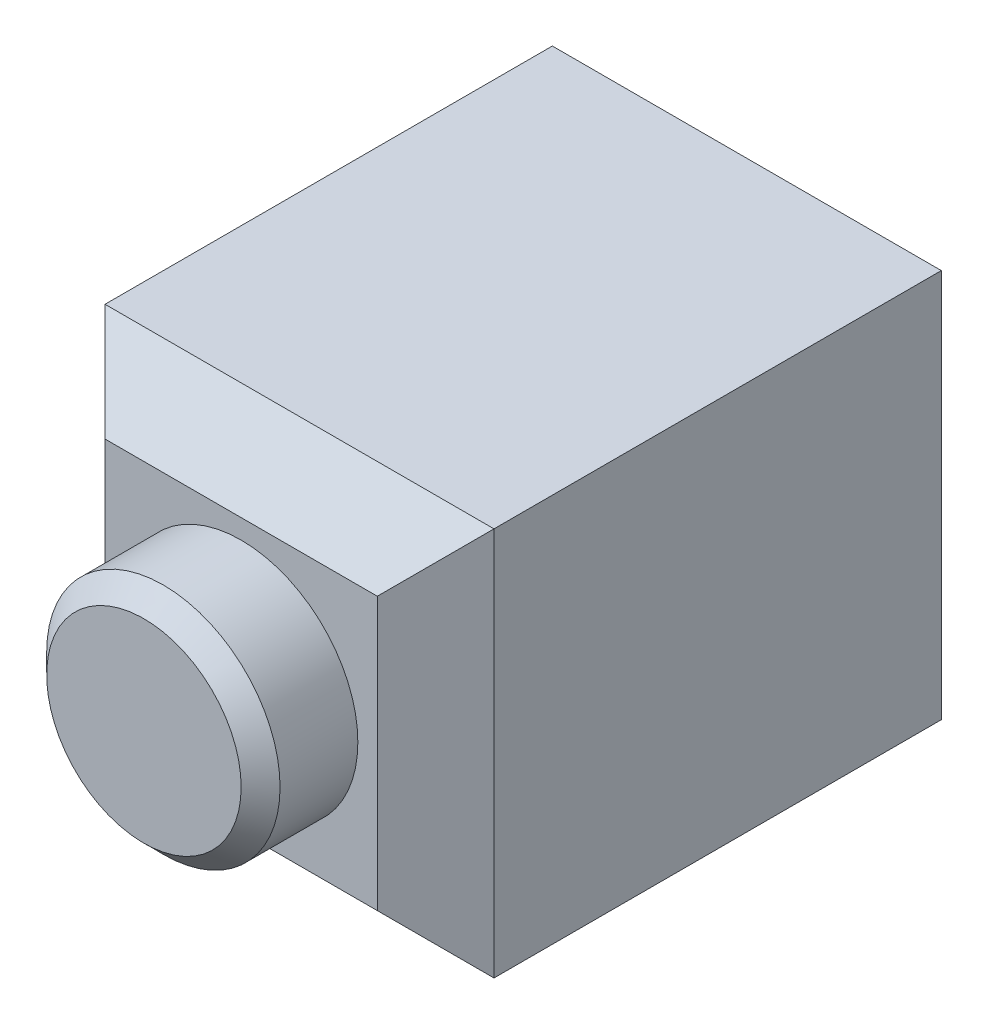
ISO-10303-21;
HEADER;
FILE_DESCRIPTION(('STEP AP214'),'2;1');
FILE_NAME('part.step','',(''),(''),'','','');
FILE_SCHEMA(('AUTOMOTIVE_DESIGN { 1 0 10303 214 1 1 1 1 }'));
ENDSEC;
DATA;
#1=APPLICATION_CONTEXT('core data for automotive mechanical design processes');
#2=APPLICATION_PROTOCOL_DEFINITION('international standard','automotive_design',2000,#1);
#3=PRODUCT_CONTEXT('',#1,'mechanical');
#4=PRODUCT('Part','Part','',(#3));
#5=PRODUCT_RELATED_PRODUCT_CATEGORY('part','',(#4));
#6=PRODUCT_DEFINITION_FORMATION('','',#4);
#7=PRODUCT_DEFINITION_CONTEXT('part definition',#1,'design');
#8=PRODUCT_DEFINITION('design','',#6,#7);
#9=PRODUCT_DEFINITION_SHAPE('','',#8);
#10=(LENGTH_UNIT() NAMED_UNIT(*) SI_UNIT(.MILLI.,.METRE.));
#11=(NAMED_UNIT(*) PLANE_ANGLE_UNIT() SI_UNIT($,.RADIAN.));
#12=(NAMED_UNIT(*) SI_UNIT($,.STERADIAN.) SOLID_ANGLE_UNIT());
#13=UNCERTAINTY_MEASURE_WITH_UNIT(LENGTH_MEASURE(1.E-05),#10,'distance_accuracy_value','');
#14=(GEOMETRIC_REPRESENTATION_CONTEXT(3) GLOBAL_UNCERTAINTY_ASSIGNED_CONTEXT((#13)) GLOBAL_UNIT_ASSIGNED_CONTEXT((#10,
#11,#12)) REPRESENTATION_CONTEXT('',''));
#15=CARTESIAN_POINT('',(0.,0.,0.));
#16=DIRECTION('',(0.,0.,1.));
#17=DIRECTION('',(1.,0.,0.));
#18=AXIS2_PLACEMENT_3D('',#15,#16,#17);
#19=CARTESIAN_POINT('',(-17.7098969830758,-13.4089220014717,26.));
#20=DIRECTION('',(0.,0.,1.));
#21=DIRECTION('',(1.,0.,0.));
#22=AXIS2_PLACEMENT_3D('',#19,#20,#21);
#23=PLANE('',#22);
#24=DIRECTION('',(0.,1.,0.));
#25=VECTOR('',#24,1.);
#26=CARTESIAN_POINT('',(-0.709896983075782,6.59107799852833,26.));
#27=LINE('',#26,#25);
#28=CARTESIAN_POINT('',(-0.709896983075779,-10.4089220014717,26.));
#29=VERTEX_POINT('',#28);
#30=CARTESIAN_POINT('',(-0.709896983075782,3.59107799852833,26.));
#31=VERTEX_POINT('',#30);
#32=EDGE_CURVE('E124',#29,#31,#27,.T.);
#33=ORIENTED_EDGE('',*,*,#32,.T.);
#34=DIRECTION('',(-1.,0.,0.));
#35=VECTOR('',#34,1.);
#36=CARTESIAN_POINT('',(-17.7098969830758,3.59107799852833,26.));
#37=LINE('',#36,#35);
#38=CARTESIAN_POINT('',(-14.7098969830758,3.59107799852833,26.));
#39=VERTEX_POINT('',#38);
#40=EDGE_CURVE('E126',#31,#39,#37,.T.);
#41=ORIENTED_EDGE('',*,*,#40,.T.);
#42=DIRECTION('',(0.,-1.,0.));
#43=VECTOR('',#42,1.);
#44=CARTESIAN_POINT('',(-14.7098969830758,-13.4089220014717,26.));
#45=LINE('',#44,#43);
#46=CARTESIAN_POINT('',(-14.7098969830758,-10.4089220014717,26.));
#47=VERTEX_POINT('',#46);
#48=EDGE_CURVE('E91',#39,#47,#45,.T.);
#49=ORIENTED_EDGE('',*,*,#48,.T.);
#50=DIRECTION('',(1.,0.,0.));
#51=VECTOR('',#50,1.);
#52=CARTESIAN_POINT('',(2.29010301692421,-10.4089220014717,26.));
#53=LINE('',#52,#51);
#54=EDGE_CURVE('E122',#47,#29,#53,.T.);
#55=ORIENTED_EDGE('',*,*,#54,.T.);
#56=EDGE_LOOP('',(#33,#41,#49,#55));
#57=FACE_BOUND('',#56,.T.);
#58=CARTESIAN_POINT('',(-7.70989698307579,-3.40892200147167,26.));
#59=DIRECTION('',(0.,0.,1.));
#60=DIRECTION('',(1.,0.,0.));
#61=AXIS2_PLACEMENT_3D('',#58,#59,#60);
#62=CIRCLE('',#61,6.);
#63=CARTESIAN_POINT('',(-1.70989698307579,-3.40892200147167,26.));
#64=VERTEX_POINT('',#63);
#65=EDGE_CURVE('E112',#64,#64,#62,.T.);
#66=ORIENTED_EDGE('',*,*,#65,.F.);
#67=EDGE_LOOP('',(#66));
#68=FACE_BOUND('',#67,.T.);
#69=ADVANCED_FACE('F31',(#57,#68),#23,.T.);
#70=CARTESIAN_POINT('',(-17.7098969830758,6.59107799852833,26.));
#71=DIRECTION('',(1.,0.,0.));
#72=DIRECTION('',(0.,0.,-1.));
#73=AXIS2_PLACEMENT_3D('',#70,#71,#72);
#74=PLANE('',#73);
#75=DIRECTION('',(0.,0.,-1.));
#76=VECTOR('',#75,1.);
#77=CARTESIAN_POINT('',(-17.7098969830758,-13.4089220014717,26.));
#78=LINE('',#77,#76);
#79=CARTESIAN_POINT('',(-17.7098969830758,-13.4089220014717,23.));
#80=VERTEX_POINT('',#79);
#81=CARTESIAN_POINT('',(-17.7098969830758,-13.4089220014717,0.));
#82=VERTEX_POINT('',#81);
#83=EDGE_CURVE('E83',#80,#82,#78,.T.);
#84=ORIENTED_EDGE('',*,*,#83,.F.);
#85=DIRECTION('',(0.,1.,0.));
#86=VECTOR('',#85,1.);
#87=CARTESIAN_POINT('',(-17.7098969830758,6.59107799852833,23.));
#88=LINE('',#87,#86);
#89=CARTESIAN_POINT('',(-17.7098969830758,6.59107799852833,23.));
#90=VERTEX_POINT('',#89);
#91=EDGE_CURVE('E134',#80,#90,#88,.T.);
#92=ORIENTED_EDGE('',*,*,#91,.T.);
#93=DIRECTION('',(0.,0.,-1.));
#94=VECTOR('',#93,1.);
#95=CARTESIAN_POINT('',(-17.7098969830758,6.59107799852833,26.));
#96=LINE('',#95,#94);
#97=CARTESIAN_POINT('',(-17.7098969830758,6.59107799852833,0.));
#98=VERTEX_POINT('',#97);
#99=EDGE_CURVE('E104',#90,#98,#96,.T.);
#100=ORIENTED_EDGE('',*,*,#99,.T.);
#101=DIRECTION('',(0.,-1.,0.));
#102=VECTOR('',#101,1.);
#103=CARTESIAN_POINT('',(-17.7098969830758,6.59107799852833,0.));
#104=LINE('',#103,#102);
#105=EDGE_CURVE('E98',#98,#82,#104,.T.);
#106=ORIENTED_EDGE('',*,*,#105,.T.);
#107=EDGE_LOOP('',(#84,#92,#100,#106));
#108=FACE_BOUND('',#107,.T.);
#109=ADVANCED_FACE('F102',(#108),#74,.F.);
#110=CARTESIAN_POINT('',(-17.7098969830758,-13.4089220014717,26.));
#111=DIRECTION('',(0.,1.,0.));
#112=DIRECTION('',(0.,0.,1.));
#113=AXIS2_PLACEMENT_3D('',#110,#111,#112);
#114=PLANE('',#113);
#115=DIRECTION('',(0.,0.,-1.));
#116=VECTOR('',#115,1.);
#117=CARTESIAN_POINT('',(2.29010301692421,-13.4089220014717,26.));
#118=LINE('',#117,#116);
#119=CARTESIAN_POINT('',(2.29010301692421,-13.4089220014717,23.));
#120=VERTEX_POINT('',#119);
#121=CARTESIAN_POINT('',(2.29010301692421,-13.4089220014717,0.));
#122=VERTEX_POINT('',#121);
#123=EDGE_CURVE('E92',#120,#122,#118,.T.);
#124=ORIENTED_EDGE('',*,*,#123,.F.);
#125=DIRECTION('',(-1.,0.,0.));
#126=VECTOR('',#125,1.);
#127=CARTESIAN_POINT('',(-17.7098969830758,-13.4089220014717,23.));
#128=LINE('',#127,#126);
#129=EDGE_CURVE('E46',#120,#80,#128,.T.);
#130=ORIENTED_EDGE('',*,*,#129,.T.);
#131=ORIENTED_EDGE('',*,*,#83,.T.);
#132=DIRECTION('',(1.,0.,0.));
#133=VECTOR('',#132,1.);
#134=CARTESIAN_POINT('',(-17.7098969830758,-13.4089220014717,0.));
#135=LINE('',#134,#133);
#136=EDGE_CURVE('E86',#82,#122,#135,.T.);
#137=ORIENTED_EDGE('',*,*,#136,.T.);
#138=EDGE_LOOP('',(#124,#130,#131,#137));
#139=FACE_BOUND('',#138,.T.);
#140=ADVANCED_FACE('F85',(#139),#114,.F.);
#141=CARTESIAN_POINT('',(2.29010301692421,6.59107799852833,26.));
#142=DIRECTION('',(-1.,0.,0.));
#143=DIRECTION('',(0.,-1.,0.));
#144=AXIS2_PLACEMENT_3D('',#141,#142,#143);
#145=PLANE('',#144);
#146=DIRECTION('',(0.,0.,-1.));
#147=VECTOR('',#146,1.);
#148=CARTESIAN_POINT('',(2.29010301692421,6.59107799852833,26.));
#149=LINE('',#148,#147);
#150=CARTESIAN_POINT('',(2.29010301692421,6.59107799852833,23.));
#151=VERTEX_POINT('',#150);
#152=CARTESIAN_POINT('',(2.29010301692421,6.59107799852833,0.));
#153=VERTEX_POINT('',#152);
#154=EDGE_CURVE('E118',#151,#153,#149,.T.);
#155=ORIENTED_EDGE('',*,*,#154,.F.);
#156=DIRECTION('',(0.,-1.,0.));
#157=VECTOR('',#156,1.);
#158=CARTESIAN_POINT('',(2.29010301692421,-13.4089220014717,23.));
#159=LINE('',#158,#157);
#160=EDGE_CURVE('E54',#151,#120,#159,.T.);
#161=ORIENTED_EDGE('',*,*,#160,.T.);
#162=ORIENTED_EDGE('',*,*,#123,.T.);
#163=DIRECTION('',(0.,1.,0.));
#164=VECTOR('',#163,1.);
#165=CARTESIAN_POINT('',(2.29010301692421,6.59107799852833,0.));
#166=LINE('',#165,#164);
#167=EDGE_CURVE('E100',#122,#153,#166,.T.);
#168=ORIENTED_EDGE('',*,*,#167,.T.);
#169=EDGE_LOOP('',(#155,#161,#162,#168));
#170=FACE_BOUND('',#169,.T.);
#171=ADVANCED_FACE('F170',(#170),#145,.F.);
#172=CARTESIAN_POINT('',(-17.7098969830758,6.59107799852833,26.));
#173=DIRECTION('',(0.,-1.,0.));
#174=DIRECTION('',(0.,0.,-1.));
#175=AXIS2_PLACEMENT_3D('',#172,#173,#174);
#176=PLANE('',#175);
#177=ORIENTED_EDGE('',*,*,#99,.F.);
#178=DIRECTION('',(1.,0.,0.));
#179=VECTOR('',#178,1.);
#180=CARTESIAN_POINT('',(2.29010301692421,6.59107799852833,23.));
#181=LINE('',#180,#179);
#182=EDGE_CURVE('E129',#90,#151,#181,.T.);
#183=ORIENTED_EDGE('',*,*,#182,.T.);
#184=ORIENTED_EDGE('',*,*,#154,.T.);
#185=DIRECTION('',(-1.,0.,0.));
#186=VECTOR('',#185,1.);
#187=CARTESIAN_POINT('',(-17.7098969830758,6.59107799852833,0.));
#188=LINE('',#187,#186);
#189=EDGE_CURVE('E115',#153,#98,#188,.T.);
#190=ORIENTED_EDGE('',*,*,#189,.T.);
#191=EDGE_LOOP('',(#177,#183,#184,#190));
#192=FACE_BOUND('',#191,.T.);
#193=ADVANCED_FACE('F167',(#192),#176,.F.);
#194=CARTESIAN_POINT('',(-17.7098969830758,-13.4089220014717,0.));
#195=DIRECTION('',(0.,0.,1.));
#196=DIRECTION('',(1.,0.,0.));
#197=AXIS2_PLACEMENT_3D('',#194,#195,#196);
#198=PLANE('',#197);
#199=ORIENTED_EDGE('',*,*,#105,.F.);
#200=ORIENTED_EDGE('',*,*,#189,.F.);
#201=ORIENTED_EDGE('',*,*,#167,.F.);
#202=ORIENTED_EDGE('',*,*,#136,.F.);
#203=EDGE_LOOP('',(#199,#200,#201,#202));
#204=FACE_BOUND('',#203,.T.);
#205=ADVANCED_FACE('F96',(#204),#198,.F.);
#206=CARTESIAN_POINT('',(-17.7098969830758,-10.4089220014717,26.));
#207=DIRECTION('',(0.,-0.707106781186549,0.707106781186546));
#208=DIRECTION('',(0.,-0.707106781186546,-0.707106781186549));
#209=AXIS2_PLACEMENT_3D('',#206,#207,#208);
#210=PLANE('',#209);
#211=DIRECTION('',(0.577350269189625,0.577350269189625,0.577350269189627));
#212=VECTOR('',#211,1.);
#213=CARTESIAN_POINT('',(-15.7098969830758,-11.4089220014717,25.));
#214=LINE('',#213,#212);
#215=EDGE_CURVE('E109',#80,#47,#214,.T.);
#216=ORIENTED_EDGE('',*,*,#215,.F.);
#217=ORIENTED_EDGE('',*,*,#129,.F.);
#218=DIRECTION('',(-0.577350269189625,0.577350269189625,0.577350269189627));
#219=VECTOR('',#218,1.);
#220=CARTESIAN_POINT('',(-6.37656364974244,-4.74225533480502,31.6666666666667));
#221=LINE('',#220,#219);
#222=EDGE_CURVE('E106',#29,#120,#221,.F.);
#223=ORIENTED_EDGE('',*,*,#222,.F.);
#224=ORIENTED_EDGE('',*,*,#54,.F.);
#225=EDGE_LOOP('',(#216,#217,#223,#224));
#226=FACE_BOUND('',#225,.T.);
#227=ADVANCED_FACE('F166',(#226),#210,.T.);
#228=CARTESIAN_POINT('',(-0.709896983075779,-13.4089220014717,26.));
#229=DIRECTION('',(0.707106781186549,0.,0.707106781186546));
#230=DIRECTION('',(0.707106781186546,0.,-0.707106781186549));
#231=AXIS2_PLACEMENT_3D('',#228,#229,#230);
#232=PLANE('',#231);
#233=ORIENTED_EDGE('',*,*,#222,.T.);
#234=ORIENTED_EDGE('',*,*,#160,.F.);
#235=DIRECTION('',(-0.577350269189625,-0.577350269189625,0.577350269189627));
#236=VECTOR('',#235,1.);
#237=CARTESIAN_POINT('',(-6.37656364974244,-2.07558866813832,31.6666666666667));
#238=LINE('',#237,#236);
#239=EDGE_CURVE('E138',#31,#151,#238,.F.);
#240=ORIENTED_EDGE('',*,*,#239,.F.);
#241=ORIENTED_EDGE('',*,*,#32,.F.);
#242=EDGE_LOOP('',(#233,#234,#240,#241));
#243=FACE_BOUND('',#242,.T.);
#244=ADVANCED_FACE('F183',(#243),#232,.T.);
#245=CARTESIAN_POINT('',(-14.7098969830758,-13.4089220014717,26.));
#246=DIRECTION('',(-0.707106781186549,0.,0.707106781186546));
#247=DIRECTION('',(0.707106781186546,0.,0.707106781186549));
#248=AXIS2_PLACEMENT_3D('',#245,#246,#247);
#249=PLANE('',#248);
#250=ORIENTED_EDGE('',*,*,#215,.T.);
#251=ORIENTED_EDGE('',*,*,#48,.F.);
#252=DIRECTION('',(-0.577350269189625,0.577350269189625,-0.577350269189627));
#253=VECTOR('',#252,1.);
#254=CARTESIAN_POINT('',(-9.04323031640914,-2.07558866813832,31.6666666666667));
#255=LINE('',#254,#253);
#256=EDGE_CURVE('E136',#90,#39,#255,.F.);
#257=ORIENTED_EDGE('',*,*,#256,.F.);
#258=ORIENTED_EDGE('',*,*,#91,.F.);
#259=EDGE_LOOP('',(#250,#251,#257,#258));
#260=FACE_BOUND('',#259,.T.);
#261=ADVANCED_FACE('F179',(#260),#249,.T.);
#262=CARTESIAN_POINT('',(-17.7098969830758,3.59107799852833,26.));
#263=DIRECTION('',(0.,0.707106781186549,0.707106781186546));
#264=DIRECTION('',(0.,-0.707106781186546,0.707106781186549));
#265=AXIS2_PLACEMENT_3D('',#262,#263,#264);
#266=PLANE('',#265);
#267=ORIENTED_EDGE('',*,*,#239,.T.);
#268=ORIENTED_EDGE('',*,*,#182,.F.);
#269=ORIENTED_EDGE('',*,*,#256,.T.);
#270=ORIENTED_EDGE('',*,*,#40,.F.);
#271=EDGE_LOOP('',(#267,#268,#269,#270));
#272=FACE_BOUND('',#271,.T.);
#273=ADVANCED_FACE('F176',(#272),#266,.T.);
#274=CARTESIAN_POINT('',(-7.70989698307579,-3.40892200147167,31.));
#275=DIRECTION('',(0.,0.,-1.));
#276=DIRECTION('',(-1.,0.,0.));
#277=AXIS2_PLACEMENT_3D('',#274,#275,#276);
#278=CYLINDRICAL_SURFACE('',#277,6.);
#279=CARTESIAN_POINT('',(-7.70989698307579,-3.40892200147167,30.));
#280=DIRECTION('',(0.,0.,1.));
#281=DIRECTION('',(1.,0.,0.));
#282=AXIS2_PLACEMENT_3D('',#279,#280,#281);
#283=CIRCLE('',#282,6.);
#284=CARTESIAN_POINT('',(-1.70989698307579,-3.40892200147167,30.));
#285=VERTEX_POINT('',#284);
#286=EDGE_CURVE('E11',#285,#285,#283,.F.);
#287=ORIENTED_EDGE('',*,*,#286,.T.);
#288=EDGE_LOOP('',(#287));
#289=FACE_BOUND('',#288,.T.);
#290=ORIENTED_EDGE('',*,*,#65,.T.);
#291=EDGE_LOOP('',(#290));
#292=FACE_BOUND('',#291,.T.);
#293=ADVANCED_FACE('F151',(#289,#292),#278,.T.);
#294=CARTESIAN_POINT('',(-7.70989698307579,-3.40892200147167,31.));
#295=DIRECTION('',(0.,0.,1.));
#296=DIRECTION('',(1.,0.,0.));
#297=AXIS2_PLACEMENT_3D('',#294,#295,#296);
#298=PLANE('',#297);
#299=CARTESIAN_POINT('',(-7.70989698307579,-3.40892200147167,31.));
#300=DIRECTION('',(0.,0.,1.));
#301=DIRECTION('',(1.,0.,0.));
#302=AXIS2_PLACEMENT_3D('',#299,#300,#301);
#303=CIRCLE('',#302,5.00000000000001);
#304=CARTESIAN_POINT('',(-2.70989698307578,-3.40892200147167,31.));
#305=VERTEX_POINT('',#304);
#306=EDGE_CURVE('E39',#305,#305,#303,.T.);
#307=ORIENTED_EDGE('',*,*,#306,.T.);
#308=EDGE_LOOP('',(#307));
#309=FACE_BOUND('',#308,.T.);
#310=ADVANCED_FACE('F144',(#309),#298,.T.);
#311=CARTESIAN_POINT('',(-7.70989698307579,-3.40892200147167,31.));
#312=DIRECTION('',(0.,0.,-1.));
#313=DIRECTION('',(-1.,0.,0.));
#314=AXIS2_PLACEMENT_3D('',#311,#312,#313);
#315=CONICAL_SURFACE('',#314,5.00000000000001,0.785398163397446);
#316=ORIENTED_EDGE('',*,*,#286,.F.);
#317=EDGE_LOOP('',(#316));
#318=FACE_BOUND('',#317,.T.);
#319=ORIENTED_EDGE('',*,*,#306,.F.);
#320=EDGE_LOOP('',(#319));
#321=FACE_BOUND('',#320,.T.);
#322=ADVANCED_FACE('F33',(#318,#321),#315,.T.);
#323=CLOSED_SHELL('',(#69,#109,#140,#171,#193,#205,#227,#244,#261,#273,#293,#310,#322));
#324=MANIFOLD_SOLID_BREP('B2',#323);
#325=ADVANCED_BREP_SHAPE_REPRESENTATION('',(#18,#324),#14);
#326=SHAPE_DEFINITION_REPRESENTATION(#9,#325);
ENDSEC;
END-ISO-10303-21;
